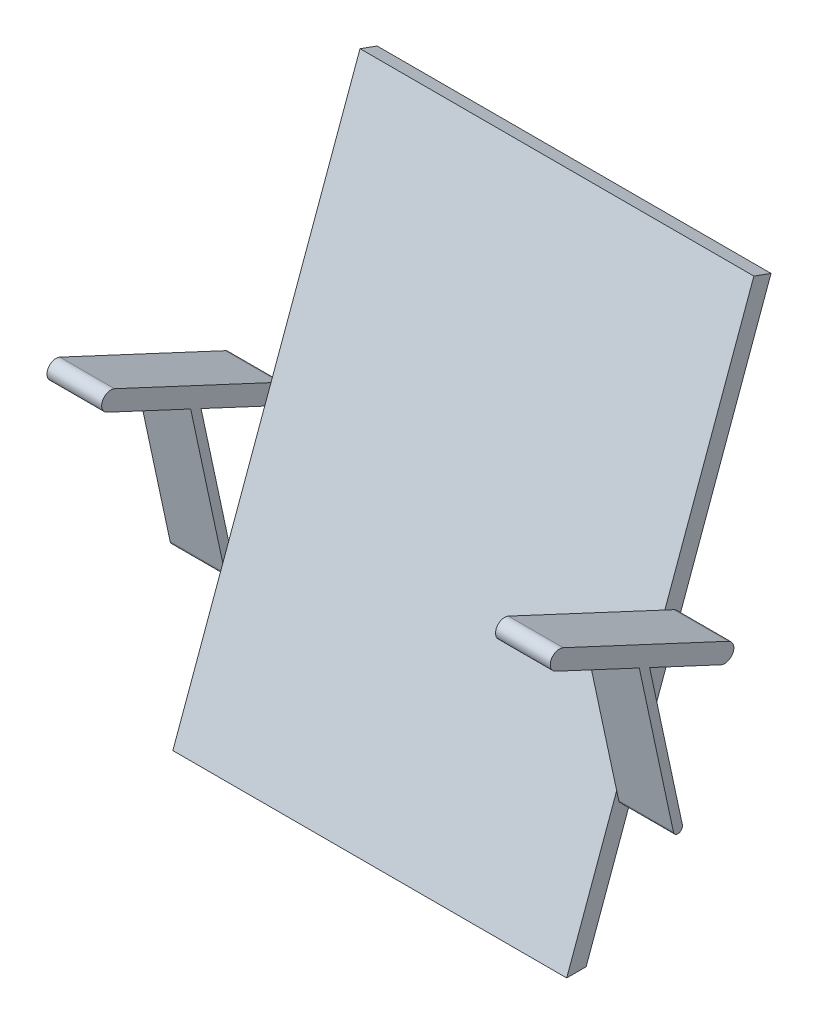
ISO-10303-21;
HEADER;
FILE_DESCRIPTION(('STEP AP214'),'2;1');
FILE_NAME('part.step','',(''),(''),'','','');
FILE_SCHEMA(('AUTOMOTIVE_DESIGN { 1 0 10303 214 1 1 1 1 }'));
ENDSEC;
DATA;
#1=APPLICATION_CONTEXT('core data for automotive mechanical design processes');
#2=APPLICATION_PROTOCOL_DEFINITION('international standard','automotive_design',2000,#1);
#3=PRODUCT_CONTEXT('',#1,'mechanical');
#4=PRODUCT('Part','Part','',(#3));
#5=PRODUCT_RELATED_PRODUCT_CATEGORY('part','',(#4));
#6=PRODUCT_DEFINITION_FORMATION('','',#4);
#7=PRODUCT_DEFINITION_CONTEXT('part definition',#1,'design');
#8=PRODUCT_DEFINITION('design','',#6,#7);
#9=PRODUCT_DEFINITION_SHAPE('','',#8);
#10=(LENGTH_UNIT() NAMED_UNIT(*) SI_UNIT(.MILLI.,.METRE.));
#11=(NAMED_UNIT(*) PLANE_ANGLE_UNIT() SI_UNIT($,.RADIAN.));
#12=(NAMED_UNIT(*) SI_UNIT($,.STERADIAN.) SOLID_ANGLE_UNIT());
#13=UNCERTAINTY_MEASURE_WITH_UNIT(LENGTH_MEASURE(1.E-05),#10,'distance_accuracy_value','');
#14=(GEOMETRIC_REPRESENTATION_CONTEXT(3) GLOBAL_UNCERTAINTY_ASSIGNED_CONTEXT((#13)) GLOBAL_UNIT_ASSIGNED_CONTEXT((#10,
#11,#12)) REPRESENTATION_CONTEXT('',''));
#15=CARTESIAN_POINT('',(0.,0.,0.));
#16=DIRECTION('',(0.,0.,1.));
#17=DIRECTION('',(1.,0.,0.));
#18=AXIS2_PLACEMENT_3D('',#15,#16,#17);
#19=CARTESIAN_POINT('',(-215.9,0.,0.));
#20=DIRECTION('',(-1.,0.,0.));
#21=DIRECTION('',(0.,0.,1.));
#22=AXIS2_PLACEMENT_3D('',#19,#20,#21);
#23=PLANE('',#22);
#24=DIRECTION('',(0.,0.422618261740706,0.906307787036647));
#25=VECTOR('',#24,1.);
#26=CARTESIAN_POINT('',(-215.9,257.718588469705,-120.176151452322));
#27=LINE('',#26,#25);
#28=CARTESIAN_POINT('',(-215.9,272.844708365406,-87.7380826555356));
#29=VERTEX_POINT('',#28);
#30=CARTESIAN_POINT('',(-215.9,276.717291244826,-79.4333018703714));
#31=VERTEX_POINT('',#30);
#32=EDGE_CURVE('E218',#29,#31,#27,.T.);
#33=ORIENTED_EDGE('',*,*,#32,.F.);
#34=CARTESIAN_POINT('',(-215.9,281.907786235772,-91.9642652729427));
#35=DIRECTION('',(1.,0.,0.));
#36=DIRECTION('',(0.,0.,-1.));
#37=AXIS2_PLACEMENT_3D('',#34,#35,#36);
#38=CIRCLE('',#37,9.99999999999995);
#39=CARTESIAN_POINT('',(-215.9,278.487584802515,-101.361191480802));
#40=VERTEX_POINT('',#39);
#41=EDGE_CURVE('E45',#29,#40,#38,.T.);
#42=ORIENTED_EDGE('',*,*,#41,.T.);
#43=DIRECTION('',(0.,0.939692620785907,-0.342020143325672));
#44=VECTOR('',#43,1.);
#45=CARTESIAN_POINT('',(-215.9,556.975169605031,-202.722382961603));
#46=LINE('',#45,#44);
#47=CARTESIAN_POINT('',(-215.9,0.,0.));
#48=VERTEX_POINT('',#47);
#49=EDGE_CURVE('E360',#48,#40,#46,.T.);
#50=ORIENTED_EDGE('',*,*,#49,.F.);
#51=DIRECTION('',(0.,0.,-1.));
#52=VECTOR('',#51,1.);
#53=CARTESIAN_POINT('',(-215.9,0.,0.));
#54=LINE('',#53,#52);
#55=CARTESIAN_POINT('',(-215.9,0.,21.2835554495182));
#56=VERTEX_POINT('',#55);
#57=EDGE_CURVE('E356',#56,#48,#54,.T.);
#58=ORIENTED_EDGE('',*,*,#57,.F.);
#59=DIRECTION('',(0.,-0.939692620785907,0.342020143325673));
#60=VECTOR('',#59,1.);
#61=CARTESIAN_POINT('',(-215.9,0.,21.2835554495182));
#62=LINE('',#61,#60);
#63=CARTESIAN_POINT('',(-215.9,150.507411660607,-33.4966624313934));
#64=VERTEX_POINT('',#63);
#65=EDGE_CURVE('E338',#64,#56,#62,.T.);
#66=ORIENTED_EDGE('',*,*,#65,.F.);
#67=DIRECTION('',(0.,-0.977728831915728,-0.209872178338881));
#68=VECTOR('',#67,1.);
#69=CARTESIAN_POINT('',(-215.9,13.502750118108,-62.9050892077286));
#70=LINE('',#69,#68);
#71=CARTESIAN_POINT('',(-215.9,139.904532226192,-35.7725996145132));
#72=VERTEX_POINT('',#71);
#73=EDGE_CURVE('E251',#64,#72,#70,.T.);
#74=ORIENTED_EDGE('',*,*,#73,.T.);
#75=CARTESIAN_POINT('',(-215.9,140.953893117886,-40.6612437740918));
#76=DIRECTION('',(1.,0.,0.));
#77=DIRECTION('',(0.,0.,-1.));
#78=AXIS2_PLACEMENT_3D('',#75,#76,#77);
#79=CIRCLE('',#78,5.);
#80=CARTESIAN_POINT('',(-215.9,142.00325400958,-45.5498879336705));
#81=VERTEX_POINT('',#80);
#82=EDGE_CURVE('E245',#72,#81,#79,.T.);
#83=ORIENTED_EDGE('',*,*,#82,.T.);
#84=DIRECTION('',(0.,-0.977728831915728,-0.209872178338881));
#85=VECTOR('',#84,1.);
#86=CARTESIAN_POINT('',(-215.9,15.6014719014968,-72.6823775268859));
#87=LINE('',#86,#85);
#88=CARTESIAN_POINT('',(-215.9,168.183489290173,-39.9302285471342));
#89=VERTEX_POINT('',#88);
#90=EDGE_CURVE('E43',#89,#81,#87,.T.);
#91=ORIENTED_EDGE('',*,*,#90,.F.);
#92=EDGE_CURVE('E420',#31,#89,#62,.T.);
#93=ORIENTED_EDGE('',*,*,#92,.F.);
#94=EDGE_LOOP('',(#33,#42,#50,#58,#66,#74,#83,#91,#93));
#95=FACE_BOUND('',#94,.T.);
#96=ADVANCED_FACE('F34',(#95),#23,.T.);
#97=CARTESIAN_POINT('',(-215.9,556.975169605031,-202.722382961603));
#98=VERTEX_POINT('',#97);
#99=EDGE_CURVE('E359',#40,#98,#46,.T.);
#100=ORIENTED_EDGE('',*,*,#99,.F.);
#101=CARTESIAN_POINT('',(-215.9,290.970864106138,-96.1904478903497));
#102=VERTEX_POINT('',#101);
#103=EDGE_CURVE('E11',#40,#102,#38,.T.);
#104=ORIENTED_EDGE('',*,*,#103,.T.);
#105=DIRECTION('',(0.,0.422618261740706,0.906307787036647));
#106=VECTOR('',#105,1.);
#107=CARTESIAN_POINT('',(-215.9,275.844744210438,-128.628516687136));
#108=LINE('',#107,#106);
#109=CARTESIAN_POINT('',(-215.9,295.582933123586,-86.299833964566));
#110=VERTEX_POINT('',#109);
#111=EDGE_CURVE('E258',#102,#110,#108,.T.);
#112=ORIENTED_EDGE('',*,*,#111,.T.);
#113=CARTESIAN_POINT('',(-215.9,563.815572471544,-183.928530545885));
#114=VERTEX_POINT('',#113);
#115=EDGE_CURVE('E353',#114,#110,#62,.T.);
#116=ORIENTED_EDGE('',*,*,#115,.F.);
#117=DIRECTION('',(0.,0.342020143325675,0.939692620785906));
#118=VECTOR('',#117,1.);
#119=CARTESIAN_POINT('',(-215.9,563.815572471544,-183.928530545885));
#120=LINE('',#119,#118);
#121=EDGE_CURVE('E363',#98,#114,#120,.T.);
#122=ORIENTED_EDGE('',*,*,#121,.F.);
#123=EDGE_LOOP('',(#100,#104,#112,#116,#122));
#124=FACE_BOUND('',#123,.T.);
#125=ADVANCED_FACE('F428',(#124),#23,.T.);
#126=CARTESIAN_POINT('',(215.9,0.,0.));
#127=DIRECTION('',(-1.,0.,0.));
#128=DIRECTION('',(0.,0.,1.));
#129=AXIS2_PLACEMENT_3D('',#126,#127,#128);
#130=PLANE('',#129);
#131=DIRECTION('',(0.,0.422618261740706,0.906307787036647));
#132=VECTOR('',#131,1.);
#133=CARTESIAN_POINT('',(215.9,275.844744210438,-128.628516687136));
#134=LINE('',#133,#132);
#135=CARTESIAN_POINT('',(215.9,290.970864106138,-96.1904478903497));
#136=VERTEX_POINT('',#135);
#137=CARTESIAN_POINT('',(215.9,295.582933123586,-86.299833964566));
#138=VERTEX_POINT('',#137);
#139=EDGE_CURVE('E306',#136,#138,#134,.T.);
#140=ORIENTED_EDGE('',*,*,#139,.F.);
#141=CARTESIAN_POINT('',(215.9,281.907786235772,-91.9642652729427));
#142=DIRECTION('',(1.,0.,0.));
#143=DIRECTION('',(0.,0.,-1.));
#144=AXIS2_PLACEMENT_3D('',#141,#142,#143);
#145=CIRCLE('',#144,9.99999999999995);
#146=CARTESIAN_POINT('',(215.9,278.487584802515,-101.361191480802));
#147=VERTEX_POINT('',#146);
#148=EDGE_CURVE('E305',#147,#136,#145,.T.);
#149=ORIENTED_EDGE('',*,*,#148,.F.);
#150=DIRECTION('',(0.,0.939692620785907,-0.342020143325672));
#151=VECTOR('',#150,1.);
#152=CARTESIAN_POINT('',(215.9,556.975169605031,-202.722382961603));
#153=LINE('',#152,#151);
#154=CARTESIAN_POINT('',(215.9,556.975169605031,-202.722382961603));
#155=VERTEX_POINT('',#154);
#156=EDGE_CURVE('E346',#147,#155,#153,.T.);
#157=ORIENTED_EDGE('',*,*,#156,.T.);
#158=DIRECTION('',(0.,0.342020143325675,0.939692620785906));
#159=VECTOR('',#158,1.);
#160=CARTESIAN_POINT('',(215.9,563.815572471544,-183.928530545885));
#161=LINE('',#160,#159);
#162=CARTESIAN_POINT('',(215.9,563.815572471544,-183.928530545885));
#163=VERTEX_POINT('',#162);
#164=EDGE_CURVE('E350',#155,#163,#161,.T.);
#165=ORIENTED_EDGE('',*,*,#164,.T.);
#166=DIRECTION('',(0.,-0.939692620785907,0.342020143325673));
#167=VECTOR('',#166,1.);
#168=CARTESIAN_POINT('',(215.9,0.,21.2835554495182));
#169=LINE('',#168,#167);
#170=EDGE_CURVE('E339',#163,#138,#169,.T.);
#171=ORIENTED_EDGE('',*,*,#170,.T.);
#172=EDGE_LOOP('',(#140,#149,#157,#165,#171));
#173=FACE_BOUND('',#172,.T.);
#174=ADVANCED_FACE('F468',(#173),#130,.F.);
#175=CARTESIAN_POINT('',(215.9,276.717291244826,-79.4333018703714));
#176=VERTEX_POINT('',#175);
#177=CARTESIAN_POINT('',(215.9,168.183489290173,-39.9302285471342));
#178=VERTEX_POINT('',#177);
#179=EDGE_CURVE('E438',#176,#178,#169,.T.);
#180=ORIENTED_EDGE('',*,*,#179,.T.);
#181=DIRECTION('',(0.,-0.977728831915728,-0.209872178338881));
#182=VECTOR('',#181,1.);
#183=CARTESIAN_POINT('',(215.9,15.6014719014968,-72.6823775268859));
#184=LINE('',#183,#182);
#185=CARTESIAN_POINT('',(215.9,142.00325400958,-45.5498879336705));
#186=VERTEX_POINT('',#185);
#187=EDGE_CURVE('E297',#178,#186,#184,.T.);
#188=ORIENTED_EDGE('',*,*,#187,.T.);
#189=CARTESIAN_POINT('',(215.9,140.953893117886,-40.6612437740918));
#190=DIRECTION('',(1.,0.,0.));
#191=DIRECTION('',(0.,0.,-1.));
#192=AXIS2_PLACEMENT_3D('',#189,#190,#191);
#193=CIRCLE('',#192,5.);
#194=CARTESIAN_POINT('',(215.9,139.904532226192,-35.7725996145132));
#195=VERTEX_POINT('',#194);
#196=EDGE_CURVE('E279',#195,#186,#193,.T.);
#197=ORIENTED_EDGE('',*,*,#196,.F.);
#198=DIRECTION('',(0.,-0.977728831915728,-0.209872178338881));
#199=VECTOR('',#198,1.);
#200=CARTESIAN_POINT('',(215.9,13.502750118108,-62.9050892077286));
#201=LINE('',#200,#199);
#202=CARTESIAN_POINT('',(215.9,150.507411660607,-33.4966624313934));
#203=VERTEX_POINT('',#202);
#204=EDGE_CURVE('E315',#203,#195,#201,.T.);
#205=ORIENTED_EDGE('',*,*,#204,.F.);
#206=CARTESIAN_POINT('',(215.9,0.,21.2835554495182));
#207=VERTEX_POINT('',#206);
#208=EDGE_CURVE('E344',#203,#207,#169,.T.);
#209=ORIENTED_EDGE('',*,*,#208,.T.);
#210=DIRECTION('',(0.,0.,-1.));
#211=VECTOR('',#210,1.);
#212=CARTESIAN_POINT('',(215.9,0.,0.));
#213=LINE('',#212,#211);
#214=CARTESIAN_POINT('',(215.9,0.,0.));
#215=VERTEX_POINT('',#214);
#216=EDGE_CURVE('E342',#207,#215,#213,.T.);
#217=ORIENTED_EDGE('',*,*,#216,.T.);
#218=EDGE_CURVE('E347',#215,#147,#153,.T.);
#219=ORIENTED_EDGE('',*,*,#218,.T.);
#220=CARTESIAN_POINT('',(215.9,272.844708365406,-87.7380826555356));
#221=VERTEX_POINT('',#220);
#222=EDGE_CURVE('E301',#221,#147,#145,.T.);
#223=ORIENTED_EDGE('',*,*,#222,.F.);
#224=DIRECTION('',(0.,0.422618261740706,0.906307787036647));
#225=VECTOR('',#224,1.);
#226=CARTESIAN_POINT('',(215.9,257.718588469705,-120.176151452322));
#227=LINE('',#226,#225);
#228=EDGE_CURVE('E298',#221,#176,#227,.T.);
#229=ORIENTED_EDGE('',*,*,#228,.T.);
#230=EDGE_LOOP('',(#180,#188,#197,#205,#209,#217,#219,#223,#229));
#231=FACE_BOUND('',#230,.T.);
#232=ADVANCED_FACE('F434',(#231),#130,.F.);
#233=CARTESIAN_POINT('',(215.9,0.,21.2835554495182));
#234=DIRECTION('',(0.,-0.342020143325673,-0.939692620785907));
#235=DIRECTION('',(0.,0.939692620785907,-0.342020143325673));
#236=AXIS2_PLACEMENT_3D('',#233,#234,#235);
#237=PLANE('',#236);
#238=ORIENTED_EDGE('',*,*,#115,.T.);
#239=EDGE_CURVE('E357',#110,#31,#62,.T.);
#240=ORIENTED_EDGE('',*,*,#239,.T.);
#241=ORIENTED_EDGE('',*,*,#92,.T.);
#242=EDGE_CURVE('E401',#89,#64,#62,.T.);
#243=ORIENTED_EDGE('',*,*,#242,.T.);
#244=ORIENTED_EDGE('',*,*,#65,.T.);
#245=DIRECTION('',(-1.,0.,0.));
#246=VECTOR('',#245,1.);
#247=CARTESIAN_POINT('',(215.9,0.,21.2835554495182));
#248=LINE('',#247,#246);
#249=EDGE_CURVE('E38',#207,#56,#248,.T.);
#250=ORIENTED_EDGE('',*,*,#249,.F.);
#251=ORIENTED_EDGE('',*,*,#208,.F.);
#252=EDGE_CURVE('E437',#178,#203,#169,.T.);
#253=ORIENTED_EDGE('',*,*,#252,.F.);
#254=ORIENTED_EDGE('',*,*,#179,.F.);
#255=EDGE_CURVE('E343',#138,#176,#169,.T.);
#256=ORIENTED_EDGE('',*,*,#255,.F.);
#257=ORIENTED_EDGE('',*,*,#170,.F.);
#258=DIRECTION('',(-1.,0.,0.));
#259=VECTOR('',#258,1.);
#260=CARTESIAN_POINT('',(215.9,563.815572471544,-183.928530545885));
#261=LINE('',#260,#259);
#262=EDGE_CURVE('E352',#163,#114,#261,.T.);
#263=ORIENTED_EDGE('',*,*,#262,.T.);
#264=EDGE_LOOP('',(#238,#240,#241,#243,#244,#250,#251,#253,#254,#256,#257,#263));
#265=FACE_BOUND('',#264,.T.);
#266=ADVANCED_FACE('F36',(#265),#237,.F.);
#267=CARTESIAN_POINT('',(215.9,0.,0.));
#268=DIRECTION('',(0.,1.,0.));
#269=DIRECTION('',(0.,0.,1.));
#270=AXIS2_PLACEMENT_3D('',#267,#268,#269);
#271=PLANE('',#270);
#272=ORIENTED_EDGE('',*,*,#57,.T.);
#273=DIRECTION('',(-1.,0.,0.));
#274=VECTOR('',#273,1.);
#275=CARTESIAN_POINT('',(215.9,0.,0.));
#276=LINE('',#275,#274);
#277=EDGE_CURVE('E369',#215,#48,#276,.T.);
#278=ORIENTED_EDGE('',*,*,#277,.F.);
#279=ORIENTED_EDGE('',*,*,#216,.F.);
#280=ORIENTED_EDGE('',*,*,#249,.T.);
#281=EDGE_LOOP('',(#272,#278,#279,#280));
#282=FACE_BOUND('',#281,.T.);
#283=ADVANCED_FACE('F431',(#282),#271,.F.);
#284=CARTESIAN_POINT('',(215.9,556.975169605031,-202.722382961603));
#285=DIRECTION('',(0.,0.342020143325673,0.939692620785907));
#286=DIRECTION('',(0.,-0.939692620785907,0.342020143325673));
#287=AXIS2_PLACEMENT_3D('',#284,#285,#286);
#288=PLANE('',#287);
#289=ORIENTED_EDGE('',*,*,#49,.T.);
#290=ORIENTED_EDGE('',*,*,#99,.T.);
#291=DIRECTION('',(-1.,0.,0.));
#292=VECTOR('',#291,1.);
#293=CARTESIAN_POINT('',(215.9,556.975169605031,-202.722382961603));
#294=LINE('',#293,#292);
#295=EDGE_CURVE('E367',#155,#98,#294,.T.);
#296=ORIENTED_EDGE('',*,*,#295,.F.);
#297=ORIENTED_EDGE('',*,*,#156,.F.);
#298=ORIENTED_EDGE('',*,*,#218,.F.);
#299=ORIENTED_EDGE('',*,*,#277,.T.);
#300=EDGE_LOOP('',(#289,#290,#296,#297,#298,#299));
#301=FACE_BOUND('',#300,.T.);
#302=ADVANCED_FACE('F430',(#301),#288,.F.);
#303=CARTESIAN_POINT('',(215.9,563.815572471544,-183.928530545885));
#304=DIRECTION('',(0.,-0.939692620785906,0.342020143325675));
#305=DIRECTION('',(0.,-0.342020143325675,-0.939692620785906));
#306=AXIS2_PLACEMENT_3D('',#303,#304,#305);
#307=PLANE('',#306);
#308=ORIENTED_EDGE('',*,*,#121,.T.);
#309=ORIENTED_EDGE('',*,*,#262,.F.);
#310=ORIENTED_EDGE('',*,*,#164,.F.);
#311=ORIENTED_EDGE('',*,*,#295,.T.);
#312=EDGE_LOOP('',(#308,#309,#310,#311));
#313=FACE_BOUND('',#312,.T.);
#314=ADVANCED_FACE('F471',(#313),#307,.F.);
#315=CARTESIAN_POINT('',(215.9,0.,0.));
#316=DIRECTION('',(1.,0.,0.));
#317=DIRECTION('',(0.,0.,-1.));
#318=AXIS2_PLACEMENT_3D('',#315,#316,#317);
#319=PLANE('',#318);
#320=CARTESIAN_POINT('',(215.9,375.49451645428,85.0711095169797));
#321=VERTEX_POINT('',#320);
#322=EDGE_CURVE('E304',#138,#321,#134,.T.);
#323=ORIENTED_EDGE('',*,*,#322,.F.);
#324=ORIENTED_EDGE('',*,*,#255,.T.);
#325=CARTESIAN_POINT('',(215.9,309.258688795176,-9.64804962059605));
#326=VERTEX_POINT('',#325);
#327=EDGE_CURVE('E296',#176,#326,#227,.T.);
#328=ORIENTED_EDGE('',*,*,#327,.T.);
#329=EDGE_CURVE('E224',#326,#178,#184,.T.);
#330=ORIENTED_EDGE('',*,*,#329,.T.);
#331=ORIENTED_EDGE('',*,*,#252,.T.);
#332=CARTESIAN_POINT('',(215.9,314.558459547838,1.71734543560272));
#333=VERTEX_POINT('',#332);
#334=EDGE_CURVE('E312',#333,#203,#201,.T.);
#335=ORIENTED_EDGE('',*,*,#334,.F.);
#336=CARTESIAN_POINT('',(215.9,357.368360713547,93.5234747517937));
#337=VERTEX_POINT('',#336);
#338=EDGE_CURVE('E302',#333,#337,#227,.T.);
#339=ORIENTED_EDGE('',*,*,#338,.T.);
#340=CARTESIAN_POINT('',(215.9,366.431438583913,89.2972921343867));
#341=DIRECTION('',(1.,0.,0.));
#342=DIRECTION('',(0.,0.,-1.));
#343=AXIS2_PLACEMENT_3D('',#340,#341,#342);
#344=CIRCLE('',#343,9.99999999999997);
#345=EDGE_CURVE('E309',#321,#337,#344,.T.);
#346=ORIENTED_EDGE('',*,*,#345,.F.);
#347=EDGE_LOOP('',(#323,#324,#328,#330,#331,#335,#339,#346));
#348=FACE_BOUND('',#347,.T.);
#349=ADVANCED_FACE('F444',(#348),#319,.F.);
#350=CARTESIAN_POINT('',(275.9,15.6014719014968,-72.6823775268859));
#351=DIRECTION('',(0.,0.209872178338881,-0.977728831915727));
#352=DIRECTION('',(0.,0.977728831915727,0.209872178338881));
#353=AXIS2_PLACEMENT_3D('',#350,#351,#352);
#354=PLANE('',#353);
#355=ORIENTED_EDGE('',*,*,#329,.F.);
#356=DIRECTION('',(-1.,0.,0.));
#357=VECTOR('',#356,1.);
#358=CARTESIAN_POINT('',(275.9,309.258688795176,-9.64804962059605));
#359=LINE('',#358,#357);
#360=CARTESIAN_POINT('',(275.9,309.258688795176,-9.64804962059605));
#361=VERTEX_POINT('',#360);
#362=EDGE_CURVE('E335',#361,#326,#359,.T.);
#363=ORIENTED_EDGE('',*,*,#362,.F.);
#364=DIRECTION('',(0.,-0.977728831915728,-0.209872178338881));
#365=VECTOR('',#364,1.);
#366=CARTESIAN_POINT('',(275.9,15.6014719014968,-72.6823775268859));
#367=LINE('',#366,#365);
#368=CARTESIAN_POINT('',(275.9,142.00325400958,-45.5498879336705));
#369=VERTEX_POINT('',#368);
#370=EDGE_CURVE('E275',#361,#369,#367,.T.);
#371=ORIENTED_EDGE('',*,*,#370,.T.);
#372=DIRECTION('',(-1.,0.,0.));
#373=VECTOR('',#372,1.);
#374=CARTESIAN_POINT('',(275.9,142.00325400958,-45.5498879336705));
#375=LINE('',#374,#373);
#376=EDGE_CURVE('E293',#369,#186,#375,.T.);
#377=ORIENTED_EDGE('',*,*,#376,.T.);
#378=ORIENTED_EDGE('',*,*,#187,.F.);
#379=EDGE_LOOP('',(#355,#363,#371,#377,#378));
#380=FACE_BOUND('',#379,.T.);
#381=ADVANCED_FACE('F478',(#380),#354,.T.);
#382=CARTESIAN_POINT('',(275.9,257.718588469705,-120.176151452322));
#383=DIRECTION('',(0.,-0.906307787036647,0.422618261740706));
#384=DIRECTION('',(0.,-0.422618261740707,-0.906307787036647));
#385=AXIS2_PLACEMENT_3D('',#382,#383,#384);
#386=PLANE('',#385);
#387=ORIENTED_EDGE('',*,*,#228,.F.);
#388=DIRECTION('',(-1.,0.,0.));
#389=VECTOR('',#388,1.);
#390=CARTESIAN_POINT('',(275.9,272.844708365406,-87.7380826555356));
#391=LINE('',#390,#389);
#392=CARTESIAN_POINT('',(275.9,272.844708365406,-87.7380826555356));
#393=VERTEX_POINT('',#392);
#394=EDGE_CURVE('E333',#393,#221,#391,.T.);
#395=ORIENTED_EDGE('',*,*,#394,.F.);
#396=DIRECTION('',(0.,0.422618261740706,0.906307787036647));
#397=VECTOR('',#396,1.);
#398=CARTESIAN_POINT('',(275.9,257.718588469705,-120.176151452322));
#399=LINE('',#398,#397);
#400=EDGE_CURVE('E278',#393,#361,#399,.T.);
#401=ORIENTED_EDGE('',*,*,#400,.T.);
#402=ORIENTED_EDGE('',*,*,#362,.T.);
#403=ORIENTED_EDGE('',*,*,#327,.F.);
#404=EDGE_LOOP('',(#387,#395,#401,#402,#403));
#405=FACE_BOUND('',#404,.T.);
#406=ADVANCED_FACE('F448',(#405),#386,.T.);
#407=CARTESIAN_POINT('',(275.9,281.907786235772,-91.9642652729427));
#408=DIRECTION('',(-1.,0.,0.));
#409=DIRECTION('',(0.,0.,1.));
#410=AXIS2_PLACEMENT_3D('',#407,#408,#409);
#411=CYLINDRICAL_SURFACE('',#410,9.99999999999995);
#412=ORIENTED_EDGE('',*,*,#222,.T.);
#413=ORIENTED_EDGE('',*,*,#148,.T.);
#414=DIRECTION('',(-1.,0.,0.));
#415=VECTOR('',#414,1.);
#416=CARTESIAN_POINT('',(275.9,290.970864106138,-96.1904478903497));
#417=LINE('',#416,#415);
#418=CARTESIAN_POINT('',(275.9,290.970864106138,-96.1904478903497));
#419=VERTEX_POINT('',#418);
#420=EDGE_CURVE('E330',#419,#136,#417,.T.);
#421=ORIENTED_EDGE('',*,*,#420,.F.);
#422=CARTESIAN_POINT('',(275.9,281.907786235772,-91.9642652729427));
#423=DIRECTION('',(1.,0.,0.));
#424=DIRECTION('',(0.,0.,-1.));
#425=AXIS2_PLACEMENT_3D('',#422,#423,#424);
#426=CIRCLE('',#425,9.99999999999995);
#427=EDGE_CURVE('E282',#393,#419,#426,.T.);
#428=ORIENTED_EDGE('',*,*,#427,.F.);
#429=ORIENTED_EDGE('',*,*,#394,.T.);
#430=EDGE_LOOP('',(#412,#413,#421,#428,#429));
#431=FACE_BOUND('',#430,.T.);
#432=ADVANCED_FACE('F492',(#431),#411,.T.);
#433=CARTESIAN_POINT('',(275.9,275.844744210438,-128.628516687136));
#434=DIRECTION('',(0.,-0.906307787036647,0.422618261740706));
#435=DIRECTION('',(0.,-0.422618261740707,-0.906307787036647));
#436=AXIS2_PLACEMENT_3D('',#433,#434,#435);
#437=PLANE('',#436);
#438=ORIENTED_EDGE('',*,*,#139,.T.);
#439=ORIENTED_EDGE('',*,*,#322,.T.);
#440=DIRECTION('',(-1.,0.,0.));
#441=VECTOR('',#440,1.);
#442=CARTESIAN_POINT('',(275.9,375.49451645428,85.0711095169797));
#443=LINE('',#442,#441);
#444=CARTESIAN_POINT('',(275.9,375.49451645428,85.0711095169797));
#445=VERTEX_POINT('',#444);
#446=EDGE_CURVE('E327',#445,#321,#443,.T.);
#447=ORIENTED_EDGE('',*,*,#446,.F.);
#448=DIRECTION('',(0.,0.422618261740706,0.906307787036647));
#449=VECTOR('',#448,1.);
#450=CARTESIAN_POINT('',(275.9,275.844744210438,-128.628516687136));
#451=LINE('',#450,#449);
#452=EDGE_CURVE('E285',#419,#445,#451,.T.);
#453=ORIENTED_EDGE('',*,*,#452,.F.);
#454=ORIENTED_EDGE('',*,*,#420,.T.);
#455=EDGE_LOOP('',(#438,#439,#447,#453,#454));
#456=FACE_BOUND('',#455,.T.);
#457=ADVANCED_FACE('F465',(#456),#437,.F.);
#458=CARTESIAN_POINT('',(275.9,366.431438583913,89.2972921343867));
#459=DIRECTION('',(-1.,0.,0.));
#460=DIRECTION('',(0.,0.,1.));
#461=AXIS2_PLACEMENT_3D('',#458,#459,#460);
#462=CYLINDRICAL_SURFACE('',#461,9.99999999999997);
#463=ORIENTED_EDGE('',*,*,#345,.T.);
#464=DIRECTION('',(-1.,0.,0.));
#465=VECTOR('',#464,1.);
#466=CARTESIAN_POINT('',(275.9,357.368360713547,93.5234747517937));
#467=LINE('',#466,#465);
#468=CARTESIAN_POINT('',(275.9,357.368360713547,93.5234747517937));
#469=VERTEX_POINT('',#468);
#470=EDGE_CURVE('E325',#469,#337,#467,.T.);
#471=ORIENTED_EDGE('',*,*,#470,.F.);
#472=CARTESIAN_POINT('',(275.9,366.431438583913,89.2972921343867));
#473=DIRECTION('',(1.,0.,0.));
#474=DIRECTION('',(0.,0.,-1.));
#475=AXIS2_PLACEMENT_3D('',#472,#473,#474);
#476=CIRCLE('',#475,9.99999999999997);
#477=EDGE_CURVE('E287',#445,#469,#476,.T.);
#478=ORIENTED_EDGE('',*,*,#477,.F.);
#479=ORIENTED_EDGE('',*,*,#446,.T.);
#480=EDGE_LOOP('',(#463,#471,#478,#479));
#481=FACE_BOUND('',#480,.T.);
#482=ADVANCED_FACE('F461',(#481),#462,.T.);
#483=ORIENTED_EDGE('',*,*,#338,.F.);
#484=DIRECTION('',(-1.,0.,0.));
#485=VECTOR('',#484,1.);
#486=CARTESIAN_POINT('',(275.9,314.558459547838,1.71734543560272));
#487=LINE('',#486,#485);
#488=CARTESIAN_POINT('',(275.9,314.558459547838,1.71734543560272));
#489=VERTEX_POINT('',#488);
#490=EDGE_CURVE('E323',#489,#333,#487,.T.);
#491=ORIENTED_EDGE('',*,*,#490,.F.);
#492=EDGE_CURVE('E283',#489,#469,#399,.T.);
#493=ORIENTED_EDGE('',*,*,#492,.T.);
#494=ORIENTED_EDGE('',*,*,#470,.T.);
#495=EDGE_LOOP('',(#483,#491,#493,#494));
#496=FACE_BOUND('',#495,.T.);
#497=ADVANCED_FACE('F454',(#496),#386,.T.);
#498=CARTESIAN_POINT('',(275.9,13.502750118108,-62.9050892077286));
#499=DIRECTION('',(0.,0.209872178338881,-0.977728831915727));
#500=DIRECTION('',(0.,0.977728831915727,0.209872178338881));
#501=AXIS2_PLACEMENT_3D('',#498,#499,#500);
#502=PLANE('',#501);
#503=ORIENTED_EDGE('',*,*,#334,.T.);
#504=ORIENTED_EDGE('',*,*,#204,.T.);
#505=DIRECTION('',(-1.,0.,0.));
#506=VECTOR('',#505,1.);
#507=CARTESIAN_POINT('',(275.9,139.904532226192,-35.7725996145132));
#508=LINE('',#507,#506);
#509=CARTESIAN_POINT('',(275.9,139.904532226192,-35.7725996145132));
#510=VERTEX_POINT('',#509);
#511=EDGE_CURVE('E320',#510,#195,#508,.T.);
#512=ORIENTED_EDGE('',*,*,#511,.F.);
#513=DIRECTION('',(0.,-0.977728831915728,-0.209872178338881));
#514=VECTOR('',#513,1.);
#515=CARTESIAN_POINT('',(275.9,13.502750118108,-62.9050892077286));
#516=LINE('',#515,#514);
#517=EDGE_CURVE('E289',#489,#510,#516,.T.);
#518=ORIENTED_EDGE('',*,*,#517,.F.);
#519=ORIENTED_EDGE('',*,*,#490,.T.);
#520=EDGE_LOOP('',(#503,#504,#512,#518,#519));
#521=FACE_BOUND('',#520,.T.);
#522=ADVANCED_FACE('F501',(#521),#502,.F.);
#523=CARTESIAN_POINT('',(275.9,140.953893117886,-40.6612437740918));
#524=DIRECTION('',(-1.,0.,0.));
#525=DIRECTION('',(0.,0.,1.));
#526=AXIS2_PLACEMENT_3D('',#523,#524,#525);
#527=CYLINDRICAL_SURFACE('',#526,5.);
#528=ORIENTED_EDGE('',*,*,#196,.T.);
#529=ORIENTED_EDGE('',*,*,#376,.F.);
#530=CARTESIAN_POINT('',(275.9,140.953893117886,-40.6612437740918));
#531=DIRECTION('',(1.,0.,0.));
#532=DIRECTION('',(0.,0.,-1.));
#533=AXIS2_PLACEMENT_3D('',#530,#531,#532);
#534=CIRCLE('',#533,5.);
#535=EDGE_CURVE('E291',#510,#369,#534,.T.);
#536=ORIENTED_EDGE('',*,*,#535,.F.);
#537=ORIENTED_EDGE('',*,*,#511,.T.);
#538=EDGE_LOOP('',(#528,#529,#536,#537));
#539=FACE_BOUND('',#538,.T.);
#540=ADVANCED_FACE('F504',(#539),#527,.T.);
#541=CARTESIAN_POINT('',(275.9,0.,0.));
#542=DIRECTION('',(1.,0.,0.));
#543=DIRECTION('',(0.,0.,-1.));
#544=AXIS2_PLACEMENT_3D('',#541,#542,#543);
#545=PLANE('',#544);
#546=ORIENTED_EDGE('',*,*,#370,.F.);
#547=ORIENTED_EDGE('',*,*,#400,.F.);
#548=ORIENTED_EDGE('',*,*,#427,.T.);
#549=ORIENTED_EDGE('',*,*,#452,.T.);
#550=ORIENTED_EDGE('',*,*,#477,.T.);
#551=ORIENTED_EDGE('',*,*,#492,.F.);
#552=ORIENTED_EDGE('',*,*,#517,.T.);
#553=ORIENTED_EDGE('',*,*,#535,.T.);
#554=EDGE_LOOP('',(#546,#547,#548,#549,#550,#551,#552,#553));
#555=FACE_BOUND('',#554,.T.);
#556=ADVANCED_FACE('F506',(#555),#545,.T.);
#557=CARTESIAN_POINT('',(-275.9,15.6014719014968,-72.6823775268859));
#558=DIRECTION('',(0.,-0.209872178338881,0.977728831915727));
#559=DIRECTION('',(0.,-0.977728831915727,-0.209872178338881));
#560=AXIS2_PLACEMENT_3D('',#557,#558,#559);
#561=PLANE('',#560);
#562=CARTESIAN_POINT('',(-215.9,309.258688795176,-9.64804962059605));
#563=VERTEX_POINT('',#562);
#564=EDGE_CURVE('E243',#563,#89,#87,.T.);
#565=ORIENTED_EDGE('',*,*,#564,.T.);
#566=ORIENTED_EDGE('',*,*,#90,.T.);
#567=DIRECTION('',(1.,0.,0.));
#568=VECTOR('',#567,1.);
#569=CARTESIAN_POINT('',(-275.9,142.00325400958,-45.5498879336705));
#570=LINE('',#569,#568);
#571=CARTESIAN_POINT('',(-275.9,142.00325400958,-45.5498879336705));
#572=VERTEX_POINT('',#571);
#573=EDGE_CURVE('E52',#572,#81,#570,.T.);
#574=ORIENTED_EDGE('',*,*,#573,.F.);
#575=DIRECTION('',(0.,-0.977728831915728,-0.209872178338881));
#576=VECTOR('',#575,1.);
#577=CARTESIAN_POINT('',(-275.9,15.6014719014968,-72.6823775268859));
#578=LINE('',#577,#576);
#579=CARTESIAN_POINT('',(-275.9,309.258688795176,-9.64804962059605));
#580=VERTEX_POINT('',#579);
#581=EDGE_CURVE('E207',#580,#572,#578,.T.);
#582=ORIENTED_EDGE('',*,*,#581,.F.);
#583=DIRECTION('',(1.,0.,0.));
#584=VECTOR('',#583,1.);
#585=CARTESIAN_POINT('',(-275.9,309.258688795176,-9.64804962059605));
#586=LINE('',#585,#584);
#587=EDGE_CURVE('E262',#580,#563,#586,.T.);
#588=ORIENTED_EDGE('',*,*,#587,.T.);
#589=EDGE_LOOP('',(#565,#566,#574,#582,#588));
#590=FACE_BOUND('',#589,.T.);
#591=ADVANCED_FACE('F221',(#590),#561,.F.);
#592=CARTESIAN_POINT('',(-275.9,140.953893117886,-40.6612437740918));
#593=DIRECTION('',(1.,0.,0.));
#594=DIRECTION('',(0.,0.,-1.));
#595=AXIS2_PLACEMENT_3D('',#592,#593,#594);
#596=CYLINDRICAL_SURFACE('',#595,5.);
#597=ORIENTED_EDGE('',*,*,#82,.F.);
#598=DIRECTION('',(1.,0.,0.));
#599=VECTOR('',#598,1.);
#600=CARTESIAN_POINT('',(-275.9,139.904532226192,-35.7725996145132));
#601=LINE('',#600,#599);
#602=CARTESIAN_POINT('',(-275.9,139.904532226192,-35.7725996145132));
#603=VERTEX_POINT('',#602);
#604=EDGE_CURVE('E225',#603,#72,#601,.T.);
#605=ORIENTED_EDGE('',*,*,#604,.F.);
#606=CARTESIAN_POINT('',(-275.9,140.953893117886,-40.6612437740918));
#607=DIRECTION('',(1.,0.,0.));
#608=DIRECTION('',(0.,0.,-1.));
#609=AXIS2_PLACEMENT_3D('',#606,#607,#608);
#610=CIRCLE('',#609,5.);
#611=EDGE_CURVE('E210',#603,#572,#610,.T.);
#612=ORIENTED_EDGE('',*,*,#611,.T.);
#613=ORIENTED_EDGE('',*,*,#573,.T.);
#614=EDGE_LOOP('',(#597,#605,#612,#613));
#615=FACE_BOUND('',#614,.T.);
#616=ADVANCED_FACE('F227',(#615),#596,.T.);
#617=CARTESIAN_POINT('',(-275.9,13.502750118108,-62.9050892077286));
#618=DIRECTION('',(0.,-0.209872178338881,0.977728831915727));
#619=DIRECTION('',(0.,-0.977728831915727,-0.209872178338881));
#620=AXIS2_PLACEMENT_3D('',#617,#618,#619);
#621=PLANE('',#620);
#622=CARTESIAN_POINT('',(-215.9,314.558459547838,1.71734543560272));
#623=VERTEX_POINT('',#622);
#624=EDGE_CURVE('E247',#623,#64,#70,.T.);
#625=ORIENTED_EDGE('',*,*,#624,.F.);
#626=DIRECTION('',(1.,0.,0.));
#627=VECTOR('',#626,1.);
#628=CARTESIAN_POINT('',(-275.9,314.558459547838,1.71734543560272));
#629=LINE('',#628,#627);
#630=CARTESIAN_POINT('',(-275.9,314.558459547838,1.71734543560272));
#631=VERTEX_POINT('',#630);
#632=EDGE_CURVE('E272',#631,#623,#629,.T.);
#633=ORIENTED_EDGE('',*,*,#632,.F.);
#634=DIRECTION('',(0.,-0.977728831915728,-0.209872178338881));
#635=VECTOR('',#634,1.);
#636=CARTESIAN_POINT('',(-275.9,13.502750118108,-62.9050892077286));
#637=LINE('',#636,#635);
#638=EDGE_CURVE('E228',#631,#603,#637,.T.);
#639=ORIENTED_EDGE('',*,*,#638,.T.);
#640=ORIENTED_EDGE('',*,*,#604,.T.);
#641=ORIENTED_EDGE('',*,*,#73,.F.);
#642=EDGE_LOOP('',(#625,#633,#639,#640,#641));
#643=FACE_BOUND('',#642,.T.);
#644=ADVANCED_FACE('F396',(#643),#621,.T.);
#645=CARTESIAN_POINT('',(-275.9,257.718588469705,-120.176151452322));
#646=DIRECTION('',(0.,0.906307787036647,-0.422618261740706));
#647=DIRECTION('',(0.,0.422618261740707,0.906307787036647));
#648=AXIS2_PLACEMENT_3D('',#645,#646,#647);
#649=PLANE('',#648);
#650=CARTESIAN_POINT('',(-215.9,357.368360713547,93.5234747517937));
#651=VERTEX_POINT('',#650);
#652=EDGE_CURVE('E250',#623,#651,#27,.T.);
#653=ORIENTED_EDGE('',*,*,#652,.T.);
#654=DIRECTION('',(1.,0.,0.));
#655=VECTOR('',#654,1.);
#656=CARTESIAN_POINT('',(-275.9,357.368360713547,93.5234747517937));
#657=LINE('',#656,#655);
#658=CARTESIAN_POINT('',(-275.9,357.368360713547,93.5234747517937));
#659=VERTEX_POINT('',#658);
#660=EDGE_CURVE('E270',#659,#651,#657,.T.);
#661=ORIENTED_EDGE('',*,*,#660,.F.);
#662=DIRECTION('',(0.,0.422618261740706,0.906307787036647));
#663=VECTOR('',#662,1.);
#664=CARTESIAN_POINT('',(-275.9,257.718588469705,-120.176151452322));
#665=LINE('',#664,#663);
#666=EDGE_CURVE('E230',#631,#659,#665,.T.);
#667=ORIENTED_EDGE('',*,*,#666,.F.);
#668=ORIENTED_EDGE('',*,*,#632,.T.);
#669=EDGE_LOOP('',(#653,#661,#667,#668));
#670=FACE_BOUND('',#669,.T.);
#671=ADVANCED_FACE('F405',(#670),#649,.F.);
#672=CARTESIAN_POINT('',(-275.9,366.431438583913,89.2972921343867));
#673=DIRECTION('',(1.,0.,0.));
#674=DIRECTION('',(0.,0.,-1.));
#675=AXIS2_PLACEMENT_3D('',#672,#673,#674);
#676=CYLINDRICAL_SURFACE('',#675,9.99999999999997);
#677=CARTESIAN_POINT('',(-215.9,366.431438583913,89.2972921343867));
#678=DIRECTION('',(1.,0.,0.));
#679=DIRECTION('',(0.,0.,-1.));
#680=AXIS2_PLACEMENT_3D('',#677,#678,#679);
#681=CIRCLE('',#680,9.99999999999997);
#682=CARTESIAN_POINT('',(-215.9,375.49451645428,85.0711095169797));
#683=VERTEX_POINT('',#682);
#684=EDGE_CURVE('E254',#683,#651,#681,.T.);
#685=ORIENTED_EDGE('',*,*,#684,.F.);
#686=DIRECTION('',(1.,0.,0.));
#687=VECTOR('',#686,1.);
#688=CARTESIAN_POINT('',(-275.9,375.49451645428,85.0711095169797));
#689=LINE('',#688,#687);
#690=CARTESIAN_POINT('',(-275.9,375.49451645428,85.0711095169797));
#691=VERTEX_POINT('',#690);
#692=EDGE_CURVE('E268',#691,#683,#689,.T.);
#693=ORIENTED_EDGE('',*,*,#692,.F.);
#694=CARTESIAN_POINT('',(-275.9,366.431438583913,89.2972921343867));
#695=DIRECTION('',(1.,0.,0.));
#696=DIRECTION('',(0.,0.,-1.));
#697=AXIS2_PLACEMENT_3D('',#694,#695,#696);
#698=CIRCLE('',#697,9.99999999999997);
#699=EDGE_CURVE('E234',#691,#659,#698,.T.);
#700=ORIENTED_EDGE('',*,*,#699,.T.);
#701=ORIENTED_EDGE('',*,*,#660,.T.);
#702=EDGE_LOOP('',(#685,#693,#700,#701));
#703=FACE_BOUND('',#702,.T.);
#704=ADVANCED_FACE('F518',(#703),#676,.T.);
#705=CARTESIAN_POINT('',(-275.9,275.844744210438,-128.628516687136));
#706=DIRECTION('',(0.,0.906307787036647,-0.422618261740706));
#707=DIRECTION('',(0.,0.422618261740707,0.906307787036647));
#708=AXIS2_PLACEMENT_3D('',#705,#706,#707);
#709=PLANE('',#708);
#710=ORIENTED_EDGE('',*,*,#111,.F.);
#711=DIRECTION('',(1.,0.,0.));
#712=VECTOR('',#711,1.);
#713=CARTESIAN_POINT('',(-275.9,290.970864106138,-96.1904478903497));
#714=LINE('',#713,#712);
#715=CARTESIAN_POINT('',(-275.9,290.970864106138,-96.1904478903497));
#716=VERTEX_POINT('',#715);
#717=EDGE_CURVE('E266',#716,#102,#714,.T.);
#718=ORIENTED_EDGE('',*,*,#717,.F.);
#719=DIRECTION('',(0.,0.422618261740706,0.906307787036647));
#720=VECTOR('',#719,1.);
#721=CARTESIAN_POINT('',(-275.9,275.844744210438,-128.628516687136));
#722=LINE('',#721,#720);
#723=EDGE_CURVE('E237',#716,#691,#722,.T.);
#724=ORIENTED_EDGE('',*,*,#723,.T.);
#725=ORIENTED_EDGE('',*,*,#692,.T.);
#726=EDGE_CURVE('E60',#110,#683,#108,.T.);
#727=ORIENTED_EDGE('',*,*,#726,.F.);
#728=EDGE_LOOP('',(#710,#718,#724,#725,#727));
#729=FACE_BOUND('',#728,.T.);
#730=ADVANCED_FACE('F410',(#729),#709,.T.);
#731=CARTESIAN_POINT('',(-275.9,281.907786235772,-91.9642652729427));
#732=DIRECTION('',(1.,0.,0.));
#733=DIRECTION('',(0.,0.,-1.));
#734=AXIS2_PLACEMENT_3D('',#731,#732,#733);
#735=CYLINDRICAL_SURFACE('',#734,9.99999999999995);
#736=ORIENTED_EDGE('',*,*,#41,.F.);
#737=DIRECTION('',(1.,0.,0.));
#738=VECTOR('',#737,1.);
#739=CARTESIAN_POINT('',(-275.9,272.844708365406,-87.7380826555356));
#740=LINE('',#739,#738);
#741=CARTESIAN_POINT('',(-275.9,272.844708365406,-87.7380826555356));
#742=VERTEX_POINT('',#741);
#743=EDGE_CURVE('E264',#742,#29,#740,.T.);
#744=ORIENTED_EDGE('',*,*,#743,.F.);
#745=CARTESIAN_POINT('',(-275.9,281.907786235772,-91.9642652729427));
#746=DIRECTION('',(1.,0.,0.));
#747=DIRECTION('',(0.,0.,-1.));
#748=AXIS2_PLACEMENT_3D('',#745,#746,#747);
#749=CIRCLE('',#748,9.99999999999995);
#750=EDGE_CURVE('E240',#742,#716,#749,.T.);
#751=ORIENTED_EDGE('',*,*,#750,.T.);
#752=ORIENTED_EDGE('',*,*,#717,.T.);
#753=ORIENTED_EDGE('',*,*,#103,.F.);
#754=EDGE_LOOP('',(#736,#744,#751,#752,#753));
#755=FACE_BOUND('',#754,.T.);
#756=ADVANCED_FACE('F413',(#755),#735,.T.);
#757=ORIENTED_EDGE('',*,*,#32,.T.);
#758=EDGE_CURVE('E255',#31,#563,#27,.T.);
#759=ORIENTED_EDGE('',*,*,#758,.T.);
#760=ORIENTED_EDGE('',*,*,#587,.F.);
#761=EDGE_CURVE('E214',#742,#580,#665,.T.);
#762=ORIENTED_EDGE('',*,*,#761,.F.);
#763=ORIENTED_EDGE('',*,*,#743,.T.);
#764=EDGE_LOOP('',(#757,#759,#760,#762,#763));
#765=FACE_BOUND('',#764,.T.);
#766=ADVANCED_FACE('F416',(#765),#649,.F.);
#767=CARTESIAN_POINT('',(-275.9,0.,0.));
#768=DIRECTION('',(-1.,0.,0.));
#769=DIRECTION('',(0.,0.,-1.));
#770=AXIS2_PLACEMENT_3D('',#767,#768,#769);
#771=PLANE('',#770);
#772=ORIENTED_EDGE('',*,*,#581,.T.);
#773=ORIENTED_EDGE('',*,*,#611,.F.);
#774=ORIENTED_EDGE('',*,*,#638,.F.);
#775=ORIENTED_EDGE('',*,*,#666,.T.);
#776=ORIENTED_EDGE('',*,*,#699,.F.);
#777=ORIENTED_EDGE('',*,*,#723,.F.);
#778=ORIENTED_EDGE('',*,*,#750,.F.);
#779=ORIENTED_EDGE('',*,*,#761,.T.);
#780=EDGE_LOOP('',(#772,#773,#774,#775,#776,#777,#778,#779));
#781=FACE_BOUND('',#780,.T.);
#782=ADVANCED_FACE('F208',(#781),#771,.T.);
#783=CARTESIAN_POINT('',(-215.9,0.,0.));
#784=DIRECTION('',(-1.,0.,0.));
#785=DIRECTION('',(0.,0.,-1.));
#786=AXIS2_PLACEMENT_3D('',#783,#784,#785);
#787=PLANE('',#786);
#788=ORIENTED_EDGE('',*,*,#239,.F.);
#789=ORIENTED_EDGE('',*,*,#726,.T.);
#790=ORIENTED_EDGE('',*,*,#684,.T.);
#791=ORIENTED_EDGE('',*,*,#652,.F.);
#792=ORIENTED_EDGE('',*,*,#624,.T.);
#793=ORIENTED_EDGE('',*,*,#242,.F.);
#794=ORIENTED_EDGE('',*,*,#564,.F.);
#795=ORIENTED_EDGE('',*,*,#758,.F.);
#796=EDGE_LOOP('',(#788,#789,#790,#791,#792,#793,#794,#795));
#797=FACE_BOUND('',#796,.T.);
#798=ADVANCED_FACE('F399',(#797),#787,.F.);
#799=CLOSED_SHELL('',(#96,#125,#174,#232,#266,#283,#302,#314,#349,#381,#406,#432,#457,#482,#497,
#522,#540,#556,#591,#616,#644,#671,#704,#730,#756,#766,#782,#798));
#800=MANIFOLD_SOLID_BREP('B2',#799);
#801=ADVANCED_BREP_SHAPE_REPRESENTATION('',(#18,#800),#14);
#802=SHAPE_DEFINITION_REPRESENTATION(#9,#801);
ENDSEC;
END-ISO-10303-21;
